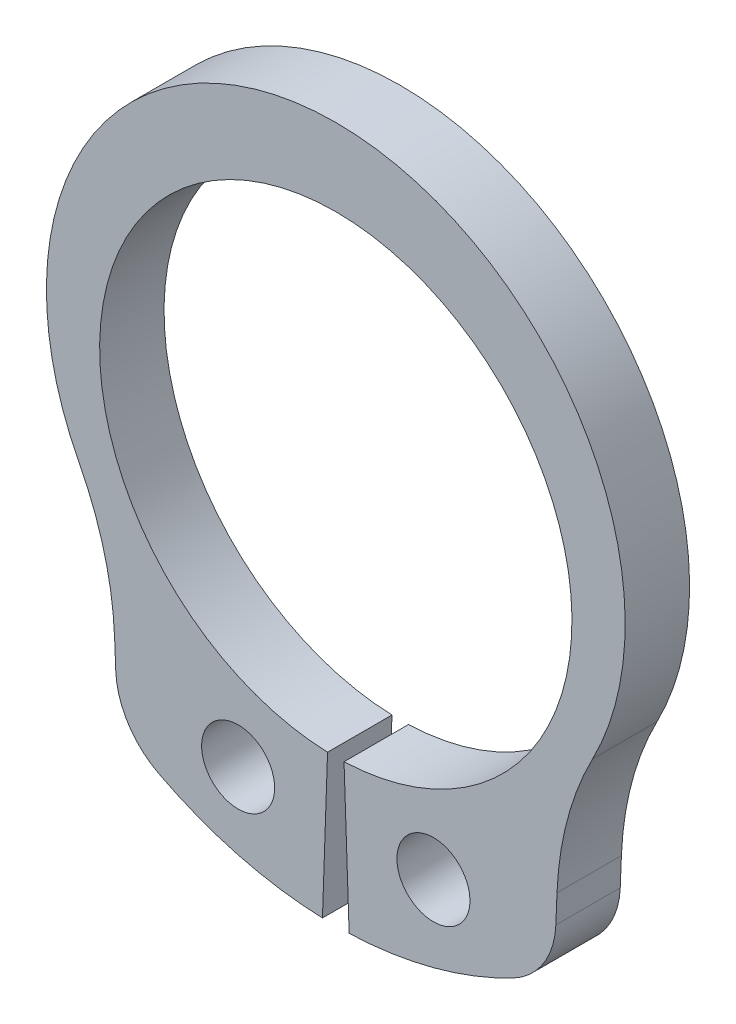
ISO-10303-21;
HEADER;
FILE_DESCRIPTION(('STEP AP214'),'2;1');
FILE_NAME('part.step','',(''),(''),'','','');
FILE_SCHEMA(('AUTOMOTIVE_DESIGN { 1 0 10303 214 1 1 1 1 }'));
ENDSEC;
DATA;
#1=APPLICATION_CONTEXT('core data for automotive mechanical design processes');
#2=APPLICATION_PROTOCOL_DEFINITION('international standard','automotive_design',2000,#1);
#3=PRODUCT_CONTEXT('',#1,'mechanical');
#4=PRODUCT('Part','Part','',(#3));
#5=PRODUCT_RELATED_PRODUCT_CATEGORY('part','',(#4));
#6=PRODUCT_DEFINITION_FORMATION('','',#4);
#7=PRODUCT_DEFINITION_CONTEXT('part definition',#1,'design');
#8=PRODUCT_DEFINITION('design','',#6,#7);
#9=PRODUCT_DEFINITION_SHAPE('','',#8);
#10=(LENGTH_UNIT() NAMED_UNIT(*) SI_UNIT(.MILLI.,.METRE.));
#11=(NAMED_UNIT(*) PLANE_ANGLE_UNIT() SI_UNIT($,.RADIAN.));
#12=(NAMED_UNIT(*) SI_UNIT($,.STERADIAN.) SOLID_ANGLE_UNIT());
#13=UNCERTAINTY_MEASURE_WITH_UNIT(LENGTH_MEASURE(1.E-05),#10,'distance_accuracy_value','');
#14=(GEOMETRIC_REPRESENTATION_CONTEXT(3) GLOBAL_UNCERTAINTY_ASSIGNED_CONTEXT((#13)) GLOBAL_UNIT_ASSIGNED_CONTEXT((#10,
#11,#12)) REPRESENTATION_CONTEXT('',''));
#15=CARTESIAN_POINT('',(0.,0.,0.));
#16=DIRECTION('',(0.,0.,1.));
#17=DIRECTION('',(1.,0.,0.));
#18=AXIS2_PLACEMENT_3D('',#15,#16,#17);
#19=CARTESIAN_POINT('',(0.,0.561131467397988,0.75));
#20=DIRECTION('',(0.,0.,1.));
#21=DIRECTION('',(1.,0.,0.));
#22=AXIS2_PLACEMENT_3D('',#19,#20,#21);
#23=PLANE('',#22);
#24=DIRECTION('',(0.0406341439629321,-0.999174092110279,0.));
#25=VECTOR('',#24,1.);
#26=CARTESIAN_POINT('',(-5.08403091681544,-7.31158143459432,0.75));
#27=LINE('',#26,#25);
#28=CARTESIAN_POINT('',(-5.15121084986287,-5.65965913319355,0.75));
#29=VERTEX_POINT('',#28);
#30=CARTESIAN_POINT('',(-5.12419446500477,-6.32397906662986,0.75));
#31=VERTEX_POINT('',#30);
#32=EDGE_CURVE('E194',#29,#31,#27,.T.);
#33=ORIENTED_EDGE('',*,*,#32,.T.);
#34=CARTESIAN_POINT('',(-3.27556824115106,-6.2487996312273,0.75));
#35=DIRECTION('',(0.,0.,1.));
#36=DIRECTION('',(1.,0.,0.));
#37=AXIS2_PLACEMENT_3D('',#34,#35,#36);
#38=CIRCLE('',#37,1.85015428087148);
#39=CARTESIAN_POINT('',(-4.13454401866462,-7.88746722310554,0.75));
#40=VERTEX_POINT('',#39);
#41=EDGE_CURVE('E12',#31,#40,#38,.T.);
#42=ORIENTED_EDGE('',*,*,#41,.T.);
#43=CARTESIAN_POINT('',(0.,0.,0.75));
#44=DIRECTION('',(0.,0.,1.));
#45=DIRECTION('',(1.,0.,0.));
#46=AXIS2_PLACEMENT_3D('',#43,#44,#45);
#47=CIRCLE('',#46,8.90542494425951);
#48=CARTESIAN_POINT('',(-0.310794848476569,-8.9,0.75));
#49=VERTEX_POINT('',#48);
#50=EDGE_CURVE('E197',#40,#49,#47,.T.);
#51=ORIENTED_EDGE('',*,*,#50,.T.);
#52=DIRECTION('',(0.0348994967025023,0.999390827019096,0.));
#53=VECTOR('',#52,1.);
#54=CARTESIAN_POINT('',(-0.310794848476569,-8.9,0.75));
#55=LINE('',#54,#53);
#56=CARTESIAN_POINT('',(-0.191947231863764,-5.49664954860502,0.75));
#57=VERTEX_POINT('',#56);
#58=EDGE_CURVE('E199',#49,#57,#55,.T.);
#59=ORIENTED_EDGE('',*,*,#58,.T.);
#60=CARTESIAN_POINT('',(0.,0.,0.75));
#61=DIRECTION('',(0.,0.,-1.));
#62=DIRECTION('',(1.,0.,0.));
#63=AXIS2_PLACEMENT_3D('',#60,#61,#62);
#64=CIRCLE('',#63,5.5);
#65=CARTESIAN_POINT('',(0.191947231863761,-5.49664954860502,0.75));
#66=VERTEX_POINT('',#65);
#67=EDGE_CURVE('E153',#57,#66,#64,.T.);
#68=ORIENTED_EDGE('',*,*,#67,.T.);
#69=DIRECTION('',(-0.0348994967025018,0.999390827019096,0.));
#70=VECTOR('',#69,1.);
#71=CARTESIAN_POINT('',(0.310794848476565,-8.9,0.75));
#72=LINE('',#71,#70);
#73=CARTESIAN_POINT('',(0.310794848476565,-8.9,0.75));
#74=VERTEX_POINT('',#73);
#75=EDGE_CURVE('E133',#74,#66,#72,.T.);
#76=ORIENTED_EDGE('',*,*,#75,.F.);
#77=CARTESIAN_POINT('',(0.,0.,0.75));
#78=DIRECTION('',(0.,0.,-1.));
#79=DIRECTION('',(-1.,0.,0.));
#80=AXIS2_PLACEMENT_3D('',#77,#78,#79);
#81=CIRCLE('',#80,8.90542494425951);
#82=CARTESIAN_POINT('',(4.13454401866461,-7.88746722310554,0.75));
#83=VERTEX_POINT('',#82);
#84=EDGE_CURVE('E143',#83,#74,#81,.T.);
#85=ORIENTED_EDGE('',*,*,#84,.F.);
#86=CARTESIAN_POINT('',(3.27556824115106,-6.2487996312273,0.75));
#87=DIRECTION('',(0.,0.,-1.));
#88=DIRECTION('',(-1.,0.,0.));
#89=AXIS2_PLACEMENT_3D('',#86,#87,#88);
#90=CIRCLE('',#89,1.85015428087148);
#91=CARTESIAN_POINT('',(5.12419446500476,-6.32397906662987,0.75));
#92=VERTEX_POINT('',#91);
#93=EDGE_CURVE('E182',#92,#83,#90,.T.);
#94=ORIENTED_EDGE('',*,*,#93,.F.);
#95=DIRECTION('',(-0.0406341439629326,-0.999174092110279,0.));
#96=VECTOR('',#95,1.);
#97=CARTESIAN_POINT('',(5.08403091681543,-7.31158143459432,0.75));
#98=LINE('',#97,#96);
#99=CARTESIAN_POINT('',(5.15121084986287,-5.65965913319355,0.75));
#100=VERTEX_POINT('',#99);
#101=EDGE_CURVE('E149',#100,#92,#98,.T.);
#102=ORIENTED_EDGE('',*,*,#101,.F.);
#103=CARTESIAN_POINT('',(12.5457157452777,-5.96037687480382,0.75));
#104=DIRECTION('',(0.,0.,-1.));
#105=DIRECTION('',(-1.,0.,0.));
#106=AXIS2_PLACEMENT_3D('',#103,#104,#105);
#107=CIRCLE('',#106,7.4006171234859);
#108=CARTESIAN_POINT('',(5.97927895760621,-2.54701464352106,0.75));
#109=VERTEX_POINT('',#108);
#110=EDGE_CURVE('E173',#109,#100,#107,.F.);
#111=ORIENTED_EDGE('',*,*,#110,.F.);
#112=CARTESIAN_POINT('',(0.,0.561131467397988,0.75));
#113=DIRECTION('',(0.,0.,1.));
#114=DIRECTION('',(1.,0.,0.));
#115=AXIS2_PLACEMENT_3D('',#112,#113,#114);
#116=CIRCLE('',#115,6.73886853260202);
#117=CARTESIAN_POINT('',(-5.97927895760621,-2.54701464352106,0.75));
#118=VERTEX_POINT('',#117);
#119=EDGE_CURVE('E191',#109,#118,#116,.T.);
#120=ORIENTED_EDGE('',*,*,#119,.T.);
#121=CARTESIAN_POINT('',(-12.5457157452777,-5.96037687480382,0.75));
#122=DIRECTION('',(0.,0.,1.));
#123=DIRECTION('',(1.,0.,0.));
#124=AXIS2_PLACEMENT_3D('',#121,#122,#123);
#125=CIRCLE('',#124,7.4006171234859);
#126=EDGE_CURVE('E224',#118,#29,#125,.F.);
#127=ORIENTED_EDGE('',*,*,#126,.T.);
#128=EDGE_LOOP('',(#33,#42,#51,#59,#68,#76,#85,#94,#102,#111,#120,#127));
#129=FACE_BOUND('',#128,.T.);
#130=CARTESIAN_POINT('',(-2.27426954112813,-6.83423477870569,0.75));
#131=DIRECTION('',(0.,0.,1.));
#132=DIRECTION('',(1.,0.,0.));
#133=AXIS2_PLACEMENT_3D('',#130,#131,#132);
#134=CIRCLE('',#133,0.85);
#135=CARTESIAN_POINT('',(-1.42426954112813,-6.83423477870569,0.75));
#136=VERTEX_POINT('',#135);
#137=EDGE_CURVE('E185',#136,#136,#134,.T.);
#138=ORIENTED_EDGE('',*,*,#137,.F.);
#139=EDGE_LOOP('',(#138));
#140=FACE_BOUND('',#139,.T.);
#141=CARTESIAN_POINT('',(2.27426954112813,-6.83423477870569,0.75));
#142=DIRECTION('',(0.,0.,-1.));
#143=DIRECTION('',(-1.,0.,0.));
#144=AXIS2_PLACEMENT_3D('',#141,#142,#143);
#145=CIRCLE('',#144,0.85);
#146=CARTESIAN_POINT('',(1.42426954112813,-6.83423477870569,0.75));
#147=VERTEX_POINT('',#146);
#148=EDGE_CURVE('E163',#147,#147,#145,.T.);
#149=ORIENTED_EDGE('',*,*,#148,.T.);
#150=EDGE_LOOP('',(#149));
#151=FACE_BOUND('',#150,.T.);
#152=ADVANCED_FACE('F39',(#129,#140,#151),#23,.T.);
#153=CARTESIAN_POINT('',(0.,0.561131467397988,-0.75));
#154=DIRECTION('',(0.,0.,1.));
#155=DIRECTION('',(1.,0.,0.));
#156=AXIS2_PLACEMENT_3D('',#153,#154,#155);
#157=PLANE('',#156);
#158=CARTESIAN_POINT('',(0.,0.,-0.75));
#159=DIRECTION('',(0.,0.,1.));
#160=DIRECTION('',(1.,0.,0.));
#161=AXIS2_PLACEMENT_3D('',#158,#159,#160);
#162=CIRCLE('',#161,8.90542494425951);
#163=CARTESIAN_POINT('',(-4.13454401866462,-7.88746722310554,-0.75));
#164=VERTEX_POINT('',#163);
#165=CARTESIAN_POINT('',(-0.310794848476569,-8.9,-0.75));
#166=VERTEX_POINT('',#165);
#167=EDGE_CURVE('E207',#164,#166,#162,.T.);
#168=ORIENTED_EDGE('',*,*,#167,.F.);
#169=CARTESIAN_POINT('',(-3.27556824115106,-6.2487996312273,-0.75));
#170=DIRECTION('',(0.,0.,1.));
#171=DIRECTION('',(1.,0.,0.));
#172=AXIS2_PLACEMENT_3D('',#169,#170,#171);
#173=CIRCLE('',#172,1.85015428087148);
#174=CARTESIAN_POINT('',(-5.12419446500477,-6.32397906662986,-0.75));
#175=VERTEX_POINT('',#174);
#176=EDGE_CURVE('E61',#164,#175,#173,.F.);
#177=ORIENTED_EDGE('',*,*,#176,.T.);
#178=DIRECTION('',(0.0406341439629321,-0.999174092110279,0.));
#179=VECTOR('',#178,1.);
#180=CARTESIAN_POINT('',(-5.08403091681544,-7.31158143459432,-0.75));
#181=LINE('',#180,#179);
#182=CARTESIAN_POINT('',(-5.15121084986287,-5.65965913319355,-0.75));
#183=VERTEX_POINT('',#182);
#184=EDGE_CURVE('E205',#183,#175,#181,.T.);
#185=ORIENTED_EDGE('',*,*,#184,.F.);
#186=CARTESIAN_POINT('',(-12.5457157452777,-5.96037687480382,-0.75));
#187=DIRECTION('',(0.,0.,1.));
#188=DIRECTION('',(1.,0.,0.));
#189=AXIS2_PLACEMENT_3D('',#186,#187,#188);
#190=CIRCLE('',#189,7.4006171234859);
#191=CARTESIAN_POINT('',(-5.97927895760621,-2.54701464352106,-0.75));
#192=VERTEX_POINT('',#191);
#193=EDGE_CURVE('E222',#183,#192,#190,.T.);
#194=ORIENTED_EDGE('',*,*,#193,.T.);
#195=CARTESIAN_POINT('',(0.,0.561131467397988,-0.75));
#196=DIRECTION('',(0.,0.,1.));
#197=DIRECTION('',(1.,0.,0.));
#198=AXIS2_PLACEMENT_3D('',#195,#196,#197);
#199=CIRCLE('',#198,6.73886853260202);
#200=CARTESIAN_POINT('',(5.97927895760621,-2.54701464352106,-0.75));
#201=VERTEX_POINT('',#200);
#202=EDGE_CURVE('E188',#201,#192,#199,.T.);
#203=ORIENTED_EDGE('',*,*,#202,.F.);
#204=CARTESIAN_POINT('',(12.5457157452777,-5.96037687480382,-0.75));
#205=DIRECTION('',(0.,0.,-1.));
#206=DIRECTION('',(-1.,0.,0.));
#207=AXIS2_PLACEMENT_3D('',#204,#205,#206);
#208=CIRCLE('',#207,7.4006171234859);
#209=CARTESIAN_POINT('',(5.15121084986287,-5.65965913319355,-0.75));
#210=VERTEX_POINT('',#209);
#211=EDGE_CURVE('E170',#210,#201,#208,.T.);
#212=ORIENTED_EDGE('',*,*,#211,.F.);
#213=DIRECTION('',(-0.0406341439629326,-0.999174092110279,0.));
#214=VECTOR('',#213,1.);
#215=CARTESIAN_POINT('',(5.08403091681543,-7.31158143459432,-0.75));
#216=LINE('',#215,#214);
#217=CARTESIAN_POINT('',(5.12419446500476,-6.32397906662987,-0.75));
#218=VERTEX_POINT('',#217);
#219=EDGE_CURVE('E159',#210,#218,#216,.T.);
#220=ORIENTED_EDGE('',*,*,#219,.T.);
#221=CARTESIAN_POINT('',(3.27556824115106,-6.2487996312273,-0.75));
#222=DIRECTION('',(0.,0.,-1.));
#223=DIRECTION('',(-1.,0.,0.));
#224=AXIS2_PLACEMENT_3D('',#221,#222,#223);
#225=CIRCLE('',#224,1.85015428087148);
#226=CARTESIAN_POINT('',(4.13454401866461,-7.88746722310554,-0.75));
#227=VERTEX_POINT('',#226);
#228=EDGE_CURVE('E177',#227,#218,#225,.F.);
#229=ORIENTED_EDGE('',*,*,#228,.F.);
#230=CARTESIAN_POINT('',(0.,0.,-0.75));
#231=DIRECTION('',(0.,0.,-1.));
#232=DIRECTION('',(-1.,0.,0.));
#233=AXIS2_PLACEMENT_3D('',#230,#231,#232);
#234=CIRCLE('',#233,8.90542494425951);
#235=CARTESIAN_POINT('',(0.310794848476565,-8.9,-0.75));
#236=VERTEX_POINT('',#235);
#237=EDGE_CURVE('E162',#227,#236,#234,.T.);
#238=ORIENTED_EDGE('',*,*,#237,.T.);
#239=DIRECTION('',(-0.0348994967025018,0.999390827019096,0.));
#240=VECTOR('',#239,1.);
#241=CARTESIAN_POINT('',(0.310794848476565,-8.9,-0.75));
#242=LINE('',#241,#240);
#243=CARTESIAN_POINT('',(0.191947231863761,-5.49664954860502,-0.75));
#244=VERTEX_POINT('',#243);
#245=EDGE_CURVE('E135',#236,#244,#242,.T.);
#246=ORIENTED_EDGE('',*,*,#245,.T.);
#247=CARTESIAN_POINT('',(0.,0.,-0.75));
#248=DIRECTION('',(0.,0.,-1.));
#249=DIRECTION('',(1.,0.,0.));
#250=AXIS2_PLACEMENT_3D('',#247,#248,#249);
#251=CIRCLE('',#250,5.5);
#252=CARTESIAN_POINT('',(-0.191947231863764,-5.49664954860502,-0.75));
#253=VERTEX_POINT('',#252);
#254=EDGE_CURVE('E195',#253,#244,#251,.T.);
#255=ORIENTED_EDGE('',*,*,#254,.F.);
#256=DIRECTION('',(0.0348994967025023,0.999390827019096,0.));
#257=VECTOR('',#256,1.);
#258=CARTESIAN_POINT('',(-0.310794848476569,-8.9,-0.75));
#259=LINE('',#258,#257);
#260=EDGE_CURVE('E209',#166,#253,#259,.T.);
#261=ORIENTED_EDGE('',*,*,#260,.F.);
#262=EDGE_LOOP('',(#168,#177,#185,#194,#203,#212,#220,#229,#238,#246,#255,#261));
#263=FACE_BOUND('',#262,.T.);
#264=CARTESIAN_POINT('',(-2.27426954112813,-6.83423477870569,-0.75));
#265=DIRECTION('',(0.,0.,1.));
#266=DIRECTION('',(1.,0.,0.));
#267=AXIS2_PLACEMENT_3D('',#264,#265,#266);
#268=CIRCLE('',#267,0.85);
#269=CARTESIAN_POINT('',(-1.42426954112813,-6.83423477870569,-0.75));
#270=VERTEX_POINT('',#269);
#271=EDGE_CURVE('E184',#270,#270,#268,.T.);
#272=ORIENTED_EDGE('',*,*,#271,.T.);
#273=EDGE_LOOP('',(#272));
#274=FACE_BOUND('',#273,.T.);
#275=CARTESIAN_POINT('',(2.27426954112813,-6.83423477870569,-0.75));
#276=DIRECTION('',(0.,0.,-1.));
#277=DIRECTION('',(-1.,0.,0.));
#278=AXIS2_PLACEMENT_3D('',#275,#276,#277);
#279=CIRCLE('',#278,0.85);
#280=CARTESIAN_POINT('',(1.42426954112813,-6.83423477870569,-0.75));
#281=VERTEX_POINT('',#280);
#282=EDGE_CURVE('E257',#281,#281,#279,.T.);
#283=ORIENTED_EDGE('',*,*,#282,.F.);
#284=EDGE_LOOP('',(#283));
#285=FACE_BOUND('',#284,.T.);
#286=ADVANCED_FACE('F237',(#263,#274,#285),#157,.F.);
#287=CARTESIAN_POINT('',(0.,0.561131467397988,0.75));
#288=DIRECTION('',(0.,0.,-1.));
#289=DIRECTION('',(-1.,0.,0.));
#290=AXIS2_PLACEMENT_3D('',#287,#288,#289);
#291=CYLINDRICAL_SURFACE('',#290,6.73886853260202);
#292=ORIENTED_EDGE('',*,*,#202,.T.);
#293=DIRECTION('',(0.,0.,-1.));
#294=VECTOR('',#293,1.);
#295=CARTESIAN_POINT('',(-5.97927895760621,-2.54701464352106,0.75));
#296=LINE('',#295,#294);
#297=EDGE_CURVE('E220',#192,#118,#296,.F.);
#298=ORIENTED_EDGE('',*,*,#297,.T.);
#299=ORIENTED_EDGE('',*,*,#119,.F.);
#300=DIRECTION('',(0.,0.,-1.));
#301=VECTOR('',#300,1.);
#302=CARTESIAN_POINT('',(5.97927895760621,-2.54701464352106,0.75));
#303=LINE('',#302,#301);
#304=EDGE_CURVE('E167',#201,#109,#303,.F.);
#305=ORIENTED_EDGE('',*,*,#304,.F.);
#306=EDGE_LOOP('',(#292,#298,#299,#305));
#307=FACE_BOUND('',#306,.T.);
#308=ADVANCED_FACE('F272',(#307),#291,.T.);
#309=CARTESIAN_POINT('',(-5.08403091681544,-7.31158143459432,0.75));
#310=DIRECTION('',(0.999174092110279,0.0406341439629321,0.));
#311=DIRECTION('',(-0.0406341439629321,0.999174092110279,0.));
#312=AXIS2_PLACEMENT_3D('',#309,#310,#311);
#313=PLANE('',#312);
#314=ORIENTED_EDGE('',*,*,#184,.T.);
#315=DIRECTION('',(0.,0.,-1.));
#316=VECTOR('',#315,1.);
#317=CARTESIAN_POINT('',(-5.12419446500477,-6.32397906662986,0.75));
#318=LINE('',#317,#316);
#319=EDGE_CURVE('E47',#175,#31,#318,.F.);
#320=ORIENTED_EDGE('',*,*,#319,.T.);
#321=ORIENTED_EDGE('',*,*,#32,.F.);
#322=DIRECTION('',(0.,0.,1.));
#323=VECTOR('',#322,1.);
#324=CARTESIAN_POINT('',(-5.15121084986287,-5.65965913319355,-0.75));
#325=LINE('',#324,#323);
#326=EDGE_CURVE('E217',#29,#183,#325,.F.);
#327=ORIENTED_EDGE('',*,*,#326,.T.);
#328=EDGE_LOOP('',(#314,#320,#321,#327));
#329=FACE_BOUND('',#328,.T.);
#330=ADVANCED_FACE('F278',(#329),#313,.F.);
#331=CARTESIAN_POINT('',(0.,0.,0.75));
#332=DIRECTION('',(0.,0.,-1.));
#333=DIRECTION('',(-1.,0.,0.));
#334=AXIS2_PLACEMENT_3D('',#331,#332,#333);
#335=CYLINDRICAL_SURFACE('',#334,8.90542494425951);
#336=ORIENTED_EDGE('',*,*,#50,.F.);
#337=DIRECTION('',(0.,0.,-1.));
#338=VECTOR('',#337,1.);
#339=CARTESIAN_POINT('',(-4.13454401866462,-7.88746722310554,0.75));
#340=LINE('',#339,#338);
#341=EDGE_CURVE('E226',#40,#164,#340,.T.);
#342=ORIENTED_EDGE('',*,*,#341,.T.);
#343=ORIENTED_EDGE('',*,*,#167,.T.);
#344=DIRECTION('',(0.,0.,-1.));
#345=VECTOR('',#344,1.);
#346=CARTESIAN_POINT('',(-0.310794848476569,-8.9,0.75));
#347=LINE('',#346,#345);
#348=EDGE_CURVE('E214',#49,#166,#347,.T.);
#349=ORIENTED_EDGE('',*,*,#348,.F.);
#350=EDGE_LOOP('',(#336,#342,#343,#349));
#351=FACE_BOUND('',#350,.T.);
#352=ADVANCED_FACE('F232',(#351),#335,.T.);
#353=CARTESIAN_POINT('',(-0.310794848476569,-8.9,0.75));
#354=DIRECTION('',(-0.999390827019096,0.0348994967025023,0.));
#355=DIRECTION('',(-0.0348994967025023,-0.999390827019096,0.));
#356=AXIS2_PLACEMENT_3D('',#353,#354,#355);
#357=PLANE('',#356);
#358=ORIENTED_EDGE('',*,*,#260,.T.);
#359=DIRECTION('',(0.,0.,-1.));
#360=VECTOR('',#359,1.);
#361=CARTESIAN_POINT('',(-0.191947231863764,-5.49664954860502,0.75));
#362=LINE('',#361,#360);
#363=EDGE_CURVE('E202',#57,#253,#362,.T.);
#364=ORIENTED_EDGE('',*,*,#363,.F.);
#365=ORIENTED_EDGE('',*,*,#58,.F.);
#366=ORIENTED_EDGE('',*,*,#348,.T.);
#367=EDGE_LOOP('',(#358,#364,#365,#366));
#368=FACE_BOUND('',#367,.T.);
#369=ADVANCED_FACE('F242',(#368),#357,.F.);
#370=CARTESIAN_POINT('',(0.,0.,0.75));
#371=DIRECTION('',(0.,0.,-1.));
#372=DIRECTION('',(-1.,0.,0.));
#373=AXIS2_PLACEMENT_3D('',#370,#371,#372);
#374=CYLINDRICAL_SURFACE('',#373,5.5);
#375=ORIENTED_EDGE('',*,*,#254,.T.);
#376=DIRECTION('',(0.,0.,-1.));
#377=VECTOR('',#376,1.);
#378=CARTESIAN_POINT('',(0.191947231863761,-5.49664954860502,0.75));
#379=LINE('',#378,#377);
#380=EDGE_CURVE('E140',#66,#244,#379,.T.);
#381=ORIENTED_EDGE('',*,*,#380,.F.);
#382=ORIENTED_EDGE('',*,*,#67,.F.);
#383=ORIENTED_EDGE('',*,*,#363,.T.);
#384=EDGE_LOOP('',(#375,#381,#382,#383));
#385=FACE_BOUND('',#384,.T.);
#386=ADVANCED_FACE('F245',(#385),#374,.F.);
#387=CARTESIAN_POINT('',(-2.27426954112813,-6.83423477870569,0.75));
#388=DIRECTION('',(0.,0.,-1.));
#389=DIRECTION('',(-1.,0.,0.));
#390=AXIS2_PLACEMENT_3D('',#387,#388,#389);
#391=CYLINDRICAL_SURFACE('',#390,0.85);
#392=ORIENTED_EDGE('',*,*,#137,.T.);
#393=EDGE_LOOP('',(#392));
#394=FACE_BOUND('',#393,.T.);
#395=ORIENTED_EDGE('',*,*,#271,.F.);
#396=EDGE_LOOP('',(#395));
#397=FACE_BOUND('',#396,.T.);
#398=ADVANCED_FACE('F286',(#394,#397),#391,.F.);
#399=CARTESIAN_POINT('',(-12.5457157452777,-5.96037687480382,0.75));
#400=DIRECTION('',(0.,0.,-1.));
#401=DIRECTION('',(-1.,0.,0.));
#402=AXIS2_PLACEMENT_3D('',#399,#400,#401);
#403=CYLINDRICAL_SURFACE('',#402,7.4006171234859);
#404=ORIENTED_EDGE('',*,*,#126,.F.);
#405=ORIENTED_EDGE('',*,*,#297,.F.);
#406=ORIENTED_EDGE('',*,*,#193,.F.);
#407=ORIENTED_EDGE('',*,*,#326,.F.);
#408=EDGE_LOOP('',(#404,#405,#406,#407));
#409=FACE_BOUND('',#408,.T.);
#410=ADVANCED_FACE('F292',(#409),#403,.F.);
#411=CARTESIAN_POINT('',(-3.27556824115106,-6.2487996312273,0.75));
#412=DIRECTION('',(0.,0.,-1.));
#413=DIRECTION('',(-1.,0.,0.));
#414=AXIS2_PLACEMENT_3D('',#411,#412,#413);
#415=CYLINDRICAL_SURFACE('',#414,1.85015428087148);
#416=ORIENTED_EDGE('',*,*,#41,.F.);
#417=ORIENTED_EDGE('',*,*,#319,.F.);
#418=ORIENTED_EDGE('',*,*,#176,.F.);
#419=ORIENTED_EDGE('',*,*,#341,.F.);
#420=EDGE_LOOP('',(#416,#417,#418,#419));
#421=FACE_BOUND('',#420,.T.);
#422=ADVANCED_FACE('F41',(#421),#415,.T.);
#423=CARTESIAN_POINT('',(5.08403091681543,-7.31158143459432,0.75));
#424=DIRECTION('',(-0.999174092110279,0.0406341439629326,0.));
#425=DIRECTION('',(0.0406341439629326,0.999174092110279,0.));
#426=AXIS2_PLACEMENT_3D('',#423,#424,#425);
#427=PLANE('',#426);
#428=ORIENTED_EDGE('',*,*,#219,.F.);
#429=DIRECTION('',(0.,0.,1.));
#430=VECTOR('',#429,1.);
#431=CARTESIAN_POINT('',(5.15121084986287,-5.65965913319355,-0.75));
#432=LINE('',#431,#430);
#433=EDGE_CURVE('E139',#100,#210,#432,.F.);
#434=ORIENTED_EDGE('',*,*,#433,.F.);
#435=ORIENTED_EDGE('',*,*,#101,.T.);
#436=DIRECTION('',(0.,0.,-1.));
#437=VECTOR('',#436,1.);
#438=CARTESIAN_POINT('',(5.12419446500476,-6.32397906662987,0.75));
#439=LINE('',#438,#437);
#440=EDGE_CURVE('E180',#218,#92,#439,.F.);
#441=ORIENTED_EDGE('',*,*,#440,.F.);
#442=EDGE_LOOP('',(#428,#434,#435,#441));
#443=FACE_BOUND('',#442,.T.);
#444=ADVANCED_FACE('F255',(#443),#427,.F.);
#445=CARTESIAN_POINT('',(0.,0.,0.75));
#446=DIRECTION('',(0.,0.,-1.));
#447=DIRECTION('',(1.,0.,0.));
#448=AXIS2_PLACEMENT_3D('',#445,#446,#447);
#449=CYLINDRICAL_SURFACE('',#448,8.90542494425951);
#450=ORIENTED_EDGE('',*,*,#84,.T.);
#451=DIRECTION('',(0.,0.,-1.));
#452=VECTOR('',#451,1.);
#453=CARTESIAN_POINT('',(0.310794848476565,-8.9,0.75));
#454=LINE('',#453,#452);
#455=EDGE_CURVE('E128',#74,#236,#454,.T.);
#456=ORIENTED_EDGE('',*,*,#455,.T.);
#457=ORIENTED_EDGE('',*,*,#237,.F.);
#458=DIRECTION('',(0.,0.,-1.));
#459=VECTOR('',#458,1.);
#460=CARTESIAN_POINT('',(4.13454401866461,-7.88746722310554,0.75));
#461=LINE('',#460,#459);
#462=EDGE_CURVE('E145',#83,#227,#461,.T.);
#463=ORIENTED_EDGE('',*,*,#462,.F.);
#464=EDGE_LOOP('',(#450,#456,#457,#463));
#465=FACE_BOUND('',#464,.T.);
#466=ADVANCED_FACE('F144',(#465),#449,.T.);
#467=CARTESIAN_POINT('',(0.310794848476565,-8.9,0.75));
#468=DIRECTION('',(0.999390827019096,0.0348994967025018,0.));
#469=DIRECTION('',(0.0348994967025018,-0.999390827019096,0.));
#470=AXIS2_PLACEMENT_3D('',#467,#468,#469);
#471=PLANE('',#470);
#472=ORIENTED_EDGE('',*,*,#245,.F.);
#473=ORIENTED_EDGE('',*,*,#455,.F.);
#474=ORIENTED_EDGE('',*,*,#75,.T.);
#475=ORIENTED_EDGE('',*,*,#380,.T.);
#476=EDGE_LOOP('',(#472,#473,#474,#475));
#477=FACE_BOUND('',#476,.T.);
#478=ADVANCED_FACE('F130',(#477),#471,.F.);
#479=CARTESIAN_POINT('',(2.27426954112813,-6.83423477870569,0.75));
#480=DIRECTION('',(0.,0.,-1.));
#481=DIRECTION('',(1.,0.,0.));
#482=AXIS2_PLACEMENT_3D('',#479,#480,#481);
#483=CYLINDRICAL_SURFACE('',#482,0.85);
#484=ORIENTED_EDGE('',*,*,#148,.F.);
#485=EDGE_LOOP('',(#484));
#486=FACE_BOUND('',#485,.T.);
#487=ORIENTED_EDGE('',*,*,#282,.T.);
#488=EDGE_LOOP('',(#487));
#489=FACE_BOUND('',#488,.T.);
#490=ADVANCED_FACE('F264',(#486,#489),#483,.F.);
#491=CARTESIAN_POINT('',(12.5457157452777,-5.96037687480382,0.75));
#492=DIRECTION('',(0.,0.,-1.));
#493=DIRECTION('',(1.,0.,0.));
#494=AXIS2_PLACEMENT_3D('',#491,#492,#493);
#495=CYLINDRICAL_SURFACE('',#494,7.4006171234859);
#496=ORIENTED_EDGE('',*,*,#110,.T.);
#497=ORIENTED_EDGE('',*,*,#433,.T.);
#498=ORIENTED_EDGE('',*,*,#211,.T.);
#499=ORIENTED_EDGE('',*,*,#304,.T.);
#500=EDGE_LOOP('',(#496,#497,#498,#499));
#501=FACE_BOUND('',#500,.T.);
#502=ADVANCED_FACE('F267',(#501),#495,.F.);
#503=CARTESIAN_POINT('',(3.27556824115106,-6.2487996312273,0.75));
#504=DIRECTION('',(0.,0.,-1.));
#505=DIRECTION('',(1.,0.,0.));
#506=AXIS2_PLACEMENT_3D('',#503,#504,#505);
#507=CYLINDRICAL_SURFACE('',#506,1.85015428087148);
#508=ORIENTED_EDGE('',*,*,#93,.T.);
#509=ORIENTED_EDGE('',*,*,#462,.T.);
#510=ORIENTED_EDGE('',*,*,#228,.T.);
#511=ORIENTED_EDGE('',*,*,#440,.T.);
#512=EDGE_LOOP('',(#508,#509,#510,#511));
#513=FACE_BOUND('',#512,.T.);
#514=ADVANCED_FACE('F250',(#513),#507,.T.);
#515=CLOSED_SHELL('',(#152,#286,#308,#330,#352,#369,#386,#398,#410,#422,#444,#466,#478,#490,
#502,#514));
#516=MANIFOLD_SOLID_BREP('B2',#515);
#517=ADVANCED_BREP_SHAPE_REPRESENTATION('',(#18,#516),#14);
#518=SHAPE_DEFINITION_REPRESENTATION(#9,#517);
ENDSEC;
END-ISO-10303-21;
